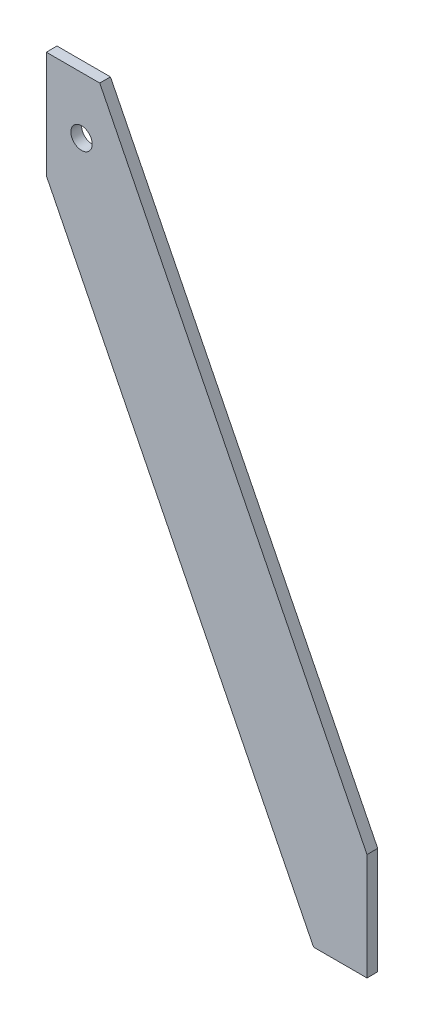
ISO-10303-21;
HEADER;
FILE_DESCRIPTION(('STEP AP214'),'2;1');
FILE_NAME('part.step','',(''),(''),'','','');
FILE_SCHEMA(('AUTOMOTIVE_DESIGN { 1 0 10303 214 1 1 1 1 }'));
ENDSEC;
DATA;
#1=APPLICATION_CONTEXT('core data for automotive mechanical design processes');
#2=APPLICATION_PROTOCOL_DEFINITION('international standard','automotive_design',2000,#1);
#3=PRODUCT_CONTEXT('',#1,'mechanical');
#4=PRODUCT('Part','Part','',(#3));
#5=PRODUCT_RELATED_PRODUCT_CATEGORY('part','',(#4));
#6=PRODUCT_DEFINITION_FORMATION('','',#4);
#7=PRODUCT_DEFINITION_CONTEXT('part definition',#1,'design');
#8=PRODUCT_DEFINITION('design','',#6,#7);
#9=PRODUCT_DEFINITION_SHAPE('','',#8);
#10=(LENGTH_UNIT() NAMED_UNIT(*) SI_UNIT(.MILLI.,.METRE.));
#11=(NAMED_UNIT(*) PLANE_ANGLE_UNIT() SI_UNIT($,.RADIAN.));
#12=(NAMED_UNIT(*) SI_UNIT($,.STERADIAN.) SOLID_ANGLE_UNIT());
#13=UNCERTAINTY_MEASURE_WITH_UNIT(LENGTH_MEASURE(1.E-05),#10,'distance_accuracy_value','');
#14=(GEOMETRIC_REPRESENTATION_CONTEXT(3) GLOBAL_UNCERTAINTY_ASSIGNED_CONTEXT((#13)) GLOBAL_UNIT_ASSIGNED_CONTEXT((#10,
#11,#12)) REPRESENTATION_CONTEXT('',''));
#15=CARTESIAN_POINT('',(0.,0.,0.));
#16=DIRECTION('',(0.,0.,1.));
#17=DIRECTION('',(1.,0.,0.));
#18=AXIS2_PLACEMENT_3D('',#15,#16,#17);
#19=CARTESIAN_POINT('',(0.,0.,4.));
#20=DIRECTION('',(0.,0.,1.));
#21=DIRECTION('',(1.,0.,0.));
#22=AXIS2_PLACEMENT_3D('',#19,#20,#21);
#23=PLANE('',#22);
#24=DIRECTION('',(1.,0.,0.));
#25=VECTOR('',#24,1.);
#26=CARTESIAN_POINT('',(0.,-83.3243967828418,4.));
#27=LINE('',#26,#25);
#28=CARTESIAN_POINT('',(-20.,-83.3243967828418,4.));
#29=VERTEX_POINT('',#28);
#30=CARTESIAN_POINT('',(0.,-83.3243967828418,4.));
#31=VERTEX_POINT('',#30);
#32=EDGE_CURVE('E129',#29,#31,#27,.T.);
#33=ORIENTED_EDGE('',*,*,#32,.T.);
#34=DIRECTION('',(0.,1.,0.));
#35=VECTOR('',#34,1.);
#36=CARTESIAN_POINT('',(0.,-83.3243967828418,4.));
#37=LINE('',#36,#35);
#38=CARTESIAN_POINT('',(0.,-43.3243967828418,4.));
#39=VERTEX_POINT('',#38);
#40=EDGE_CURVE('E87',#31,#39,#37,.T.);
#41=ORIENTED_EDGE('',*,*,#40,.T.);
#42=DIRECTION('',(-0.447213595499958,0.894427190999916,0.));
#43=VECTOR('',#42,1.);
#44=CARTESIAN_POINT('',(-100.,156.675603217158,4.));
#45=LINE('',#44,#43);
#46=CARTESIAN_POINT('',(-100.,156.675603217158,4.));
#47=VERTEX_POINT('',#46);
#48=EDGE_CURVE('E100',#39,#47,#45,.T.);
#49=ORIENTED_EDGE('',*,*,#48,.T.);
#50=DIRECTION('',(-1.,0.,0.));
#51=VECTOR('',#50,1.);
#52=CARTESIAN_POINT('',(-120.,156.675603217158,4.));
#53=LINE('',#52,#51);
#54=CARTESIAN_POINT('',(-120.,156.675603217158,4.));
#55=VERTEX_POINT('',#54);
#56=EDGE_CURVE('E94',#47,#55,#53,.T.);
#57=ORIENTED_EDGE('',*,*,#56,.T.);
#58=DIRECTION('',(0.,-1.,0.));
#59=VECTOR('',#58,1.);
#60=CARTESIAN_POINT('',(-120.,156.675603217158,4.));
#61=LINE('',#60,#59);
#62=CARTESIAN_POINT('',(-120.,116.675603217158,4.));
#63=VERTEX_POINT('',#62);
#64=EDGE_CURVE('E98',#55,#63,#61,.T.);
#65=ORIENTED_EDGE('',*,*,#64,.T.);
#66=DIRECTION('',(0.447213595499958,-0.894427190999916,0.));
#67=VECTOR('',#66,1.);
#68=CARTESIAN_POINT('',(-120.,116.675603217158,4.));
#69=LINE('',#68,#67);
#70=EDGE_CURVE('E50',#63,#29,#69,.T.);
#71=ORIENTED_EDGE('',*,*,#70,.T.);
#72=EDGE_LOOP('',(#33,#41,#49,#57,#65,#71));
#73=FACE_BOUND('',#72,.T.);
#74=CARTESIAN_POINT('',(-106.809651474531,135.44235924933,4.));
#75=DIRECTION('',(0.,0.,1.));
#76=DIRECTION('',(1.,0.,0.));
#77=AXIS2_PLACEMENT_3D('',#74,#75,#76);
#78=CIRCLE('',#77,4.00000000000001);
#79=CARTESIAN_POINT('',(-102.809651474531,135.44235924933,4.));
#80=VERTEX_POINT('',#79);
#81=EDGE_CURVE('E122',#80,#80,#78,.T.);
#82=ORIENTED_EDGE('',*,*,#81,.F.);
#83=EDGE_LOOP('',(#82));
#84=FACE_BOUND('',#83,.T.);
#85=ADVANCED_FACE('F33',(#73,#84),#23,.T.);
#86=CARTESIAN_POINT('',(0.,0.,0.));
#87=DIRECTION('',(0.,0.,1.));
#88=DIRECTION('',(1.,0.,0.));
#89=AXIS2_PLACEMENT_3D('',#86,#87,#88);
#90=PLANE('',#89);
#91=DIRECTION('',(1.,0.,0.));
#92=VECTOR('',#91,1.);
#93=CARTESIAN_POINT('',(0.,-83.3243967828418,0.));
#94=LINE('',#93,#92);
#95=CARTESIAN_POINT('',(-20.,-83.3243967828418,0.));
#96=VERTEX_POINT('',#95);
#97=CARTESIAN_POINT('',(0.,-83.3243967828418,0.));
#98=VERTEX_POINT('',#97);
#99=EDGE_CURVE('E118',#96,#98,#94,.T.);
#100=ORIENTED_EDGE('',*,*,#99,.F.);
#101=DIRECTION('',(0.447213595499958,-0.894427190999916,0.));
#102=VECTOR('',#101,1.);
#103=CARTESIAN_POINT('',(-120.,116.675603217158,0.));
#104=LINE('',#103,#102);
#105=CARTESIAN_POINT('',(-120.,116.675603217158,0.));
#106=VERTEX_POINT('',#105);
#107=EDGE_CURVE('E79',#106,#96,#104,.T.);
#108=ORIENTED_EDGE('',*,*,#107,.F.);
#109=DIRECTION('',(0.,-1.,0.));
#110=VECTOR('',#109,1.);
#111=CARTESIAN_POINT('',(-120.,156.675603217158,0.));
#112=LINE('',#111,#110);
#113=CARTESIAN_POINT('',(-120.,156.675603217158,0.));
#114=VERTEX_POINT('',#113);
#115=EDGE_CURVE('E73',#114,#106,#112,.T.);
#116=ORIENTED_EDGE('',*,*,#115,.F.);
#117=DIRECTION('',(-1.,0.,0.));
#118=VECTOR('',#117,1.);
#119=CARTESIAN_POINT('',(-120.,156.675603217158,0.));
#120=LINE('',#119,#118);
#121=CARTESIAN_POINT('',(-100.,156.675603217158,0.));
#122=VERTEX_POINT('',#121);
#123=EDGE_CURVE('E108',#122,#114,#120,.T.);
#124=ORIENTED_EDGE('',*,*,#123,.F.);
#125=DIRECTION('',(-0.447213595499958,0.894427190999916,0.));
#126=VECTOR('',#125,1.);
#127=CARTESIAN_POINT('',(-100.,156.675603217158,0.));
#128=LINE('',#127,#126);
#129=CARTESIAN_POINT('',(0.,-43.3243967828418,0.));
#130=VERTEX_POINT('',#129);
#131=EDGE_CURVE('E124',#130,#122,#128,.T.);
#132=ORIENTED_EDGE('',*,*,#131,.F.);
#133=DIRECTION('',(0.,1.,0.));
#134=VECTOR('',#133,1.);
#135=CARTESIAN_POINT('',(0.,-83.3243967828418,0.));
#136=LINE('',#135,#134);
#137=EDGE_CURVE('E121',#98,#130,#136,.T.);
#138=ORIENTED_EDGE('',*,*,#137,.F.);
#139=EDGE_LOOP('',(#100,#108,#116,#124,#132,#138));
#140=FACE_BOUND('',#139,.T.);
#141=CARTESIAN_POINT('',(-106.809651474531,135.44235924933,0.));
#142=DIRECTION('',(0.,0.,1.));
#143=DIRECTION('',(1.,0.,0.));
#144=AXIS2_PLACEMENT_3D('',#141,#142,#143);
#145=CIRCLE('',#144,4.00000000000001);
#146=CARTESIAN_POINT('',(-102.809651474531,135.44235924933,0.));
#147=VERTEX_POINT('',#146);
#148=EDGE_CURVE('E222',#147,#147,#145,.T.);
#149=ORIENTED_EDGE('',*,*,#148,.T.);
#150=EDGE_LOOP('',(#149));
#151=FACE_BOUND('',#150,.T.);
#152=ADVANCED_FACE('F138',(#140,#151),#90,.F.);
#153=CARTESIAN_POINT('',(0.,-83.3243967828418,4.));
#154=DIRECTION('',(0.,1.,0.));
#155=DIRECTION('',(0.,0.,1.));
#156=AXIS2_PLACEMENT_3D('',#153,#154,#155);
#157=PLANE('',#156);
#158=ORIENTED_EDGE('',*,*,#99,.T.);
#159=DIRECTION('',(0.,0.,-1.));
#160=VECTOR('',#159,1.);
#161=CARTESIAN_POINT('',(0.,-83.3243967828418,4.));
#162=LINE('',#161,#160);
#163=EDGE_CURVE('E11',#31,#98,#162,.T.);
#164=ORIENTED_EDGE('',*,*,#163,.F.);
#165=ORIENTED_EDGE('',*,*,#32,.F.);
#166=DIRECTION('',(0.,0.,-1.));
#167=VECTOR('',#166,1.);
#168=CARTESIAN_POINT('',(-20.,-83.3243967828418,4.));
#169=LINE('',#168,#167);
#170=EDGE_CURVE('E114',#29,#96,#169,.T.);
#171=ORIENTED_EDGE('',*,*,#170,.T.);
#172=EDGE_LOOP('',(#158,#164,#165,#171));
#173=FACE_BOUND('',#172,.T.);
#174=ADVANCED_FACE('F35',(#173),#157,.F.);
#175=CARTESIAN_POINT('',(0.,-83.3243967828418,4.));
#176=DIRECTION('',(-1.,0.,0.));
#177=DIRECTION('',(0.,0.,1.));
#178=AXIS2_PLACEMENT_3D('',#175,#176,#177);
#179=PLANE('',#178);
#180=ORIENTED_EDGE('',*,*,#137,.T.);
#181=DIRECTION('',(0.,0.,-1.));
#182=VECTOR('',#181,1.);
#183=CARTESIAN_POINT('',(0.,-43.3243967828418,4.));
#184=LINE('',#183,#182);
#185=EDGE_CURVE('E42',#39,#130,#184,.T.);
#186=ORIENTED_EDGE('',*,*,#185,.F.);
#187=ORIENTED_EDGE('',*,*,#40,.F.);
#188=ORIENTED_EDGE('',*,*,#163,.T.);
#189=EDGE_LOOP('',(#180,#186,#187,#188));
#190=FACE_BOUND('',#189,.T.);
#191=ADVANCED_FACE('F163',(#190),#179,.F.);
#192=CARTESIAN_POINT('',(-100.,156.675603217158,4.));
#193=DIRECTION('',(-0.894427190999916,-0.447213595499958,0.));
#194=DIRECTION('',(0.447213595499958,-0.894427190999916,0.));
#195=AXIS2_PLACEMENT_3D('',#192,#193,#194);
#196=PLANE('',#195);
#197=ORIENTED_EDGE('',*,*,#131,.T.);
#198=DIRECTION('',(0.,0.,-1.));
#199=VECTOR('',#198,1.);
#200=CARTESIAN_POINT('',(-100.,156.675603217158,4.));
#201=LINE('',#200,#199);
#202=EDGE_CURVE('E109',#47,#122,#201,.T.);
#203=ORIENTED_EDGE('',*,*,#202,.F.);
#204=ORIENTED_EDGE('',*,*,#48,.F.);
#205=ORIENTED_EDGE('',*,*,#185,.T.);
#206=EDGE_LOOP('',(#197,#203,#204,#205));
#207=FACE_BOUND('',#206,.T.);
#208=ADVANCED_FACE('F135',(#207),#196,.F.);
#209=CARTESIAN_POINT('',(-120.,156.675603217158,4.));
#210=DIRECTION('',(0.,-1.,0.));
#211=DIRECTION('',(0.,0.,-1.));
#212=AXIS2_PLACEMENT_3D('',#209,#210,#211);
#213=PLANE('',#212);
#214=ORIENTED_EDGE('',*,*,#123,.T.);
#215=DIRECTION('',(0.,0.,-1.));
#216=VECTOR('',#215,1.);
#217=CARTESIAN_POINT('',(-120.,156.675603217158,4.));
#218=LINE('',#217,#216);
#219=EDGE_CURVE('E105',#55,#114,#218,.T.);
#220=ORIENTED_EDGE('',*,*,#219,.F.);
#221=ORIENTED_EDGE('',*,*,#56,.F.);
#222=ORIENTED_EDGE('',*,*,#202,.T.);
#223=EDGE_LOOP('',(#214,#220,#221,#222));
#224=FACE_BOUND('',#223,.T.);
#225=ADVANCED_FACE('F106',(#224),#213,.F.);
#226=CARTESIAN_POINT('',(-120.,156.675603217158,4.));
#227=DIRECTION('',(1.,0.,0.));
#228=DIRECTION('',(0.,0.,-1.));
#229=AXIS2_PLACEMENT_3D('',#226,#227,#228);
#230=PLANE('',#229);
#231=ORIENTED_EDGE('',*,*,#115,.T.);
#232=DIRECTION('',(0.,0.,-1.));
#233=VECTOR('',#232,1.);
#234=CARTESIAN_POINT('',(-120.,116.675603217158,4.));
#235=LINE('',#234,#233);
#236=EDGE_CURVE('E110',#63,#106,#235,.T.);
#237=ORIENTED_EDGE('',*,*,#236,.F.);
#238=ORIENTED_EDGE('',*,*,#64,.F.);
#239=ORIENTED_EDGE('',*,*,#219,.T.);
#240=EDGE_LOOP('',(#231,#237,#238,#239));
#241=FACE_BOUND('',#240,.T.);
#242=ADVANCED_FACE('F112',(#241),#230,.F.);
#243=CARTESIAN_POINT('',(-120.,116.675603217158,4.));
#244=DIRECTION('',(0.894427190999916,0.447213595499958,0.));
#245=DIRECTION('',(-0.447213595499958,0.894427190999916,0.));
#246=AXIS2_PLACEMENT_3D('',#243,#244,#245);
#247=PLANE('',#246);
#248=ORIENTED_EDGE('',*,*,#107,.T.);
#249=ORIENTED_EDGE('',*,*,#170,.F.);
#250=ORIENTED_EDGE('',*,*,#70,.F.);
#251=ORIENTED_EDGE('',*,*,#236,.T.);
#252=EDGE_LOOP('',(#248,#249,#250,#251));
#253=FACE_BOUND('',#252,.T.);
#254=ADVANCED_FACE('F143',(#253),#247,.F.);
#255=CARTESIAN_POINT('',(-106.809651474531,135.44235924933,4.));
#256=DIRECTION('',(0.,0.,-1.));
#257=DIRECTION('',(-1.,0.,0.));
#258=AXIS2_PLACEMENT_3D('',#255,#256,#257);
#259=CYLINDRICAL_SURFACE('',#258,4.00000000000001);
#260=ORIENTED_EDGE('',*,*,#81,.T.);
#261=EDGE_LOOP('',(#260));
#262=FACE_BOUND('',#261,.T.);
#263=ORIENTED_EDGE('',*,*,#148,.F.);
#264=EDGE_LOOP('',(#263));
#265=FACE_BOUND('',#264,.T.);
#266=ADVANCED_FACE('F145',(#262,#265),#259,.F.);
#267=CLOSED_SHELL('',(#85,#152,#174,#191,#208,#225,#242,#254,#266));
#268=MANIFOLD_SOLID_BREP('B2',#267);
#269=ADVANCED_BREP_SHAPE_REPRESENTATION('',(#18,#268),#14);
#270=SHAPE_DEFINITION_REPRESENTATION(#9,#269);
ENDSEC;
END-ISO-10303-21;
